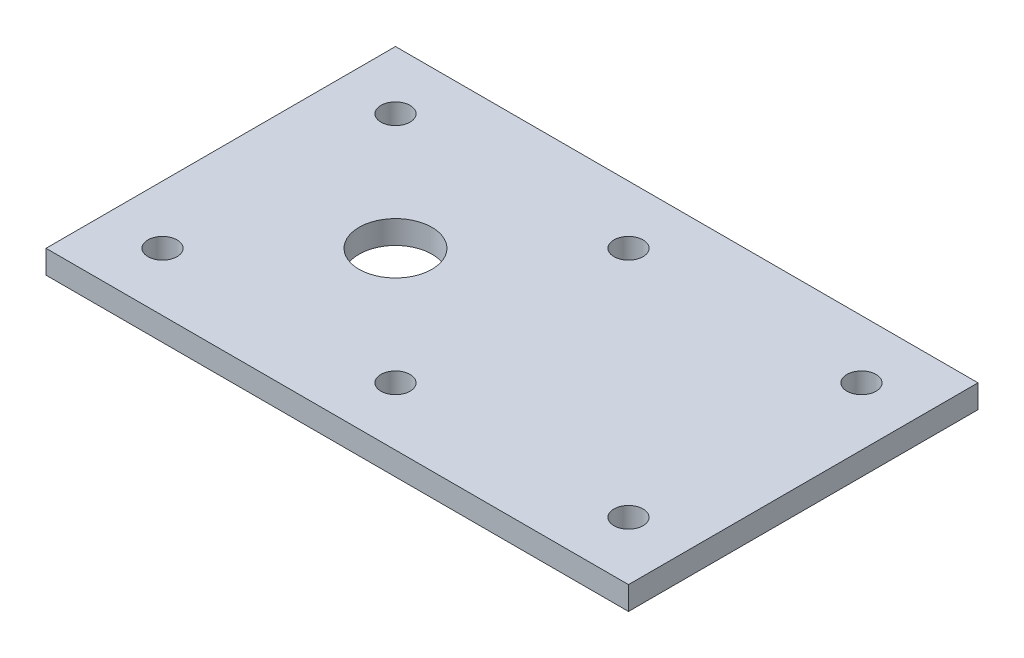
ISO-10303-21;
HEADER;
FILE_DESCRIPTION(('STEP AP214'),'2;1');
FILE_NAME('part.step','',(''),(''),'','','');
FILE_SCHEMA(('AUTOMOTIVE_DESIGN { 1 0 10303 214 1 1 1 1 }'));
ENDSEC;
DATA;
#1=APPLICATION_CONTEXT('core data for automotive mechanical design processes');
#2=APPLICATION_PROTOCOL_DEFINITION('international standard','automotive_design',2000,#1);
#3=PRODUCT_CONTEXT('',#1,'mechanical');
#4=PRODUCT('Part','Part','',(#3));
#5=PRODUCT_RELATED_PRODUCT_CATEGORY('part','',(#4));
#6=PRODUCT_DEFINITION_FORMATION('','',#4);
#7=PRODUCT_DEFINITION_CONTEXT('part definition',#1,'design');
#8=PRODUCT_DEFINITION('design','',#6,#7);
#9=PRODUCT_DEFINITION_SHAPE('','',#8);
#10=(LENGTH_UNIT() NAMED_UNIT(*) SI_UNIT(.MILLI.,.METRE.));
#11=(NAMED_UNIT(*) PLANE_ANGLE_UNIT() SI_UNIT($,.RADIAN.));
#12=(NAMED_UNIT(*) SI_UNIT($,.STERADIAN.) SOLID_ANGLE_UNIT());
#13=UNCERTAINTY_MEASURE_WITH_UNIT(LENGTH_MEASURE(1.E-05),#10,'distance_accuracy_value','');
#14=(GEOMETRIC_REPRESENTATION_CONTEXT(3) GLOBAL_UNCERTAINTY_ASSIGNED_CONTEXT((#13)) GLOBAL_UNIT_ASSIGNED_CONTEXT((#10,
#11,#12)) REPRESENTATION_CONTEXT('',''));
#15=CARTESIAN_POINT('',(0.,0.,0.));
#16=DIRECTION('',(0.,0.,1.));
#17=DIRECTION('',(1.,0.,0.));
#18=AXIS2_PLACEMENT_3D('',#15,#16,#17);
#19=CARTESIAN_POINT('',(120.,0.,40.));
#20=DIRECTION('',(0.,1.,0.));
#21=DIRECTION('',(0.,0.,1.));
#22=AXIS2_PLACEMENT_3D('',#19,#20,#21);
#23=CYLINDRICAL_SURFACE('',#22,5.);
#24=CARTESIAN_POINT('',(120.,0.,40.));
#25=DIRECTION('',(0.,1.,0.));
#26=DIRECTION('',(0.,0.,1.));
#27=AXIS2_PLACEMENT_3D('',#24,#25,#26);
#28=CIRCLE('',#27,5.);
#29=CARTESIAN_POINT('',(120.,0.,45.));
#30=VERTEX_POINT('',#29);
#31=EDGE_CURVE('E42',#30,#30,#28,.T.);
#32=ORIENTED_EDGE('',*,*,#31,.F.);
#33=EDGE_LOOP('',(#32));
#34=FACE_BOUND('',#33,.T.);
#35=CARTESIAN_POINT('',(120.,8.,40.));
#36=DIRECTION('',(0.,1.,0.));
#37=DIRECTION('',(0.,0.,1.));
#38=AXIS2_PLACEMENT_3D('',#35,#36,#37);
#39=CIRCLE('',#38,5.);
#40=CARTESIAN_POINT('',(120.,8.,45.));
#41=VERTEX_POINT('',#40);
#42=EDGE_CURVE('E11',#41,#41,#39,.T.);
#43=ORIENTED_EDGE('',*,*,#42,.T.);
#44=EDGE_LOOP('',(#43));
#45=FACE_BOUND('',#44,.T.);
#46=ADVANCED_FACE('F33',(#34,#45),#23,.F.);
#47=CARTESIAN_POINT('',(120.,0.,-40.));
#48=DIRECTION('',(0.,1.,0.));
#49=DIRECTION('',(0.,0.,1.));
#50=AXIS2_PLACEMENT_3D('',#47,#48,#49);
#51=CYLINDRICAL_SURFACE('',#50,5.);
#52=CARTESIAN_POINT('',(120.,0.,-40.));
#53=DIRECTION('',(0.,1.,0.));
#54=DIRECTION('',(0.,0.,1.));
#55=AXIS2_PLACEMENT_3D('',#52,#53,#54);
#56=CIRCLE('',#55,5.);
#57=CARTESIAN_POINT('',(120.,0.,-35.));
#58=VERTEX_POINT('',#57);
#59=EDGE_CURVE('E124',#58,#58,#56,.T.);
#60=ORIENTED_EDGE('',*,*,#59,.F.);
#61=EDGE_LOOP('',(#60));
#62=FACE_BOUND('',#61,.T.);
#63=CARTESIAN_POINT('',(120.,8.,-40.));
#64=DIRECTION('',(0.,1.,0.));
#65=DIRECTION('',(0.,0.,1.));
#66=AXIS2_PLACEMENT_3D('',#63,#64,#65);
#67=CIRCLE('',#66,5.);
#68=CARTESIAN_POINT('',(120.,8.,-35.));
#69=VERTEX_POINT('',#68);
#70=EDGE_CURVE('E127',#69,#69,#67,.T.);
#71=ORIENTED_EDGE('',*,*,#70,.T.);
#72=EDGE_LOOP('',(#71));
#73=FACE_BOUND('',#72,.T.);
#74=ADVANCED_FACE('F137',(#62,#73),#51,.F.);
#75=CARTESIAN_POINT('',(40.,0.,40.));
#76=DIRECTION('',(0.,1.,0.));
#77=DIRECTION('',(0.,0.,1.));
#78=AXIS2_PLACEMENT_3D('',#75,#76,#77);
#79=CYLINDRICAL_SURFACE('',#78,5.);
#80=CARTESIAN_POINT('',(40.,0.,40.));
#81=DIRECTION('',(0.,1.,0.));
#82=DIRECTION('',(0.,0.,1.));
#83=AXIS2_PLACEMENT_3D('',#80,#81,#82);
#84=CIRCLE('',#83,5.);
#85=CARTESIAN_POINT('',(40.,0.,45.));
#86=VERTEX_POINT('',#85);
#87=EDGE_CURVE('E118',#86,#86,#84,.T.);
#88=ORIENTED_EDGE('',*,*,#87,.F.);
#89=EDGE_LOOP('',(#88));
#90=FACE_BOUND('',#89,.T.);
#91=CARTESIAN_POINT('',(40.,8.,40.));
#92=DIRECTION('',(0.,1.,0.));
#93=DIRECTION('',(0.,0.,1.));
#94=AXIS2_PLACEMENT_3D('',#91,#92,#93);
#95=CIRCLE('',#94,5.);
#96=CARTESIAN_POINT('',(40.,8.,45.));
#97=VERTEX_POINT('',#96);
#98=EDGE_CURVE('E121',#97,#97,#95,.T.);
#99=ORIENTED_EDGE('',*,*,#98,.T.);
#100=EDGE_LOOP('',(#99));
#101=FACE_BOUND('',#100,.T.);
#102=ADVANCED_FACE('F168',(#90,#101),#79,.F.);
#103=CARTESIAN_POINT('',(40.,0.,-40.));
#104=DIRECTION('',(0.,1.,0.));
#105=DIRECTION('',(0.,0.,1.));
#106=AXIS2_PLACEMENT_3D('',#103,#104,#105);
#107=CYLINDRICAL_SURFACE('',#106,5.);
#108=CARTESIAN_POINT('',(40.,0.,-40.));
#109=DIRECTION('',(0.,1.,0.));
#110=DIRECTION('',(0.,0.,1.));
#111=AXIS2_PLACEMENT_3D('',#108,#109,#110);
#112=CIRCLE('',#111,5.);
#113=CARTESIAN_POINT('',(40.,0.,-35.));
#114=VERTEX_POINT('',#113);
#115=EDGE_CURVE('E112',#114,#114,#112,.T.);
#116=ORIENTED_EDGE('',*,*,#115,.F.);
#117=EDGE_LOOP('',(#116));
#118=FACE_BOUND('',#117,.T.);
#119=CARTESIAN_POINT('',(40.,8.,-40.));
#120=DIRECTION('',(0.,1.,0.));
#121=DIRECTION('',(0.,0.,1.));
#122=AXIS2_PLACEMENT_3D('',#119,#120,#121);
#123=CIRCLE('',#122,5.);
#124=CARTESIAN_POINT('',(40.,8.,-35.));
#125=VERTEX_POINT('',#124);
#126=EDGE_CURVE('E115',#125,#125,#123,.T.);
#127=ORIENTED_EDGE('',*,*,#126,.T.);
#128=EDGE_LOOP('',(#127));
#129=FACE_BOUND('',#128,.T.);
#130=ADVANCED_FACE('F164',(#118,#129),#107,.F.);
#131=CARTESIAN_POINT('',(-60.,8.,-60.));
#132=DIRECTION('',(1.,0.,0.));
#133=DIRECTION('',(0.,0.,-1.));
#134=AXIS2_PLACEMENT_3D('',#131,#132,#133);
#135=PLANE('',#134);
#136=DIRECTION('',(0.,0.,1.));
#137=VECTOR('',#136,1.);
#138=CARTESIAN_POINT('',(-60.,0.,-60.));
#139=LINE('',#138,#137);
#140=CARTESIAN_POINT('',(-60.,0.,-60.));
#141=VERTEX_POINT('',#140);
#142=CARTESIAN_POINT('',(-60.,0.,60.));
#143=VERTEX_POINT('',#142);
#144=EDGE_CURVE('E102',#141,#143,#139,.T.);
#145=ORIENTED_EDGE('',*,*,#144,.T.);
#146=DIRECTION('',(0.,-1.,0.));
#147=VECTOR('',#146,1.);
#148=CARTESIAN_POINT('',(-60.,8.,60.));
#149=LINE('',#148,#147);
#150=CARTESIAN_POINT('',(-60.,8.,60.));
#151=VERTEX_POINT('',#150);
#152=EDGE_CURVE('E93',#151,#143,#149,.T.);
#153=ORIENTED_EDGE('',*,*,#152,.F.);
#154=DIRECTION('',(0.,0.,1.));
#155=VECTOR('',#154,1.);
#156=CARTESIAN_POINT('',(-60.,8.,-60.));
#157=LINE('',#156,#155);
#158=CARTESIAN_POINT('',(-60.,8.,-60.));
#159=VERTEX_POINT('',#158);
#160=EDGE_CURVE('E87',#159,#151,#157,.T.);
#161=ORIENTED_EDGE('',*,*,#160,.F.);
#162=DIRECTION('',(0.,-1.,0.));
#163=VECTOR('',#162,1.);
#164=CARTESIAN_POINT('',(-60.,8.,-60.));
#165=LINE('',#164,#163);
#166=EDGE_CURVE('E98',#159,#141,#165,.T.);
#167=ORIENTED_EDGE('',*,*,#166,.T.);
#168=EDGE_LOOP('',(#145,#153,#161,#167));
#169=FACE_BOUND('',#168,.T.);
#170=ADVANCED_FACE('F161',(#169),#135,.F.);
#171=CARTESIAN_POINT('',(-60.,8.,60.));
#172=DIRECTION('',(0.,0.,-1.));
#173=DIRECTION('',(-1.,0.,0.));
#174=AXIS2_PLACEMENT_3D('',#171,#172,#173);
#175=PLANE('',#174);
#176=DIRECTION('',(1.,0.,0.));
#177=VECTOR('',#176,1.);
#178=CARTESIAN_POINT('',(-60.,0.,60.));
#179=LINE('',#178,#177);
#180=CARTESIAN_POINT('',(140.,0.,60.));
#181=VERTEX_POINT('',#180);
#182=EDGE_CURVE('E92',#143,#181,#179,.T.);
#183=ORIENTED_EDGE('',*,*,#182,.T.);
#184=DIRECTION('',(0.,-1.,0.));
#185=VECTOR('',#184,1.);
#186=CARTESIAN_POINT('',(140.,8.,60.));
#187=LINE('',#186,#185);
#188=CARTESIAN_POINT('',(140.,8.,60.));
#189=VERTEX_POINT('',#188);
#190=EDGE_CURVE('E90',#189,#181,#187,.T.);
#191=ORIENTED_EDGE('',*,*,#190,.F.);
#192=DIRECTION('',(1.,0.,0.));
#193=VECTOR('',#192,1.);
#194=CARTESIAN_POINT('',(-60.,8.,60.));
#195=LINE('',#194,#193);
#196=EDGE_CURVE('E81',#151,#189,#195,.T.);
#197=ORIENTED_EDGE('',*,*,#196,.F.);
#198=ORIENTED_EDGE('',*,*,#152,.T.);
#199=EDGE_LOOP('',(#183,#191,#197,#198));
#200=FACE_BOUND('',#199,.T.);
#201=ADVANCED_FACE('F91',(#200),#175,.F.);
#202=CARTESIAN_POINT('',(140.,8.,-60.));
#203=DIRECTION('',(-1.,0.,0.));
#204=DIRECTION('',(0.,0.,1.));
#205=AXIS2_PLACEMENT_3D('',#202,#203,#204);
#206=PLANE('',#205);
#207=DIRECTION('',(0.,0.,-1.));
#208=VECTOR('',#207,1.);
#209=CARTESIAN_POINT('',(140.,0.,-60.));
#210=LINE('',#209,#208);
#211=CARTESIAN_POINT('',(140.,0.,-60.));
#212=VERTEX_POINT('',#211);
#213=EDGE_CURVE('E67',#181,#212,#210,.T.);
#214=ORIENTED_EDGE('',*,*,#213,.T.);
#215=DIRECTION('',(0.,-1.,0.));
#216=VECTOR('',#215,1.);
#217=CARTESIAN_POINT('',(140.,8.,-60.));
#218=LINE('',#217,#216);
#219=CARTESIAN_POINT('',(140.,8.,-60.));
#220=VERTEX_POINT('',#219);
#221=EDGE_CURVE('E94',#220,#212,#218,.T.);
#222=ORIENTED_EDGE('',*,*,#221,.F.);
#223=DIRECTION('',(0.,0.,-1.));
#224=VECTOR('',#223,1.);
#225=CARTESIAN_POINT('',(140.,8.,-60.));
#226=LINE('',#225,#224);
#227=EDGE_CURVE('E85',#189,#220,#226,.T.);
#228=ORIENTED_EDGE('',*,*,#227,.F.);
#229=ORIENTED_EDGE('',*,*,#190,.T.);
#230=EDGE_LOOP('',(#214,#222,#228,#229));
#231=FACE_BOUND('',#230,.T.);
#232=ADVANCED_FACE('F96',(#231),#206,.F.);
#233=CARTESIAN_POINT('',(-60.,8.,-60.));
#234=DIRECTION('',(0.,0.,1.));
#235=DIRECTION('',(1.,0.,0.));
#236=AXIS2_PLACEMENT_3D('',#233,#234,#235);
#237=PLANE('',#236);
#238=DIRECTION('',(-1.,0.,0.));
#239=VECTOR('',#238,1.);
#240=CARTESIAN_POINT('',(-60.,0.,-60.));
#241=LINE('',#240,#239);
#242=EDGE_CURVE('E73',#212,#141,#241,.T.);
#243=ORIENTED_EDGE('',*,*,#242,.T.);
#244=ORIENTED_EDGE('',*,*,#166,.F.);
#245=DIRECTION('',(-1.,0.,0.));
#246=VECTOR('',#245,1.);
#247=CARTESIAN_POINT('',(-60.,8.,-60.));
#248=LINE('',#247,#246);
#249=EDGE_CURVE('E50',#220,#159,#248,.T.);
#250=ORIENTED_EDGE('',*,*,#249,.F.);
#251=ORIENTED_EDGE('',*,*,#221,.T.);
#252=EDGE_LOOP('',(#243,#244,#250,#251));
#253=FACE_BOUND('',#252,.T.);
#254=ADVANCED_FACE('F141',(#253),#237,.F.);
#255=CARTESIAN_POINT('',(0.,8.,0.));
#256=DIRECTION('',(0.,1.,0.));
#257=DIRECTION('',(0.,0.,1.));
#258=AXIS2_PLACEMENT_3D('',#255,#256,#257);
#259=PLANE('',#258);
#260=CARTESIAN_POINT('',(0.,8.,0.));
#261=DIRECTION('',(0.,1.,0.));
#262=DIRECTION('',(0.,0.,1.));
#263=AXIS2_PLACEMENT_3D('',#260,#261,#262);
#264=CIRCLE('',#263,12.5);
#265=CARTESIAN_POINT('',(0.,8.,12.5));
#266=VERTEX_POINT('',#265);
#267=EDGE_CURVE('E260',#266,#266,#264,.T.);
#268=ORIENTED_EDGE('',*,*,#267,.F.);
#269=EDGE_LOOP('',(#268));
#270=FACE_BOUND('',#269,.T.);
#271=CARTESIAN_POINT('',(-40.,8.,40.));
#272=DIRECTION('',(0.,1.,0.));
#273=DIRECTION('',(0.,0.,1.));
#274=AXIS2_PLACEMENT_3D('',#271,#272,#273);
#275=CIRCLE('',#274,5.);
#276=CARTESIAN_POINT('',(-40.,8.,45.));
#277=VERTEX_POINT('',#276);
#278=EDGE_CURVE('E265',#277,#277,#275,.T.);
#279=ORIENTED_EDGE('',*,*,#278,.F.);
#280=EDGE_LOOP('',(#279));
#281=FACE_BOUND('',#280,.T.);
#282=CARTESIAN_POINT('',(-40.,8.,-40.));
#283=DIRECTION('',(0.,1.,0.));
#284=DIRECTION('',(0.,0.,1.));
#285=AXIS2_PLACEMENT_3D('',#282,#283,#284);
#286=CIRCLE('',#285,5.);
#287=CARTESIAN_POINT('',(-40.,8.,-35.));
#288=VERTEX_POINT('',#287);
#289=EDGE_CURVE('E271',#288,#288,#286,.T.);
#290=ORIENTED_EDGE('',*,*,#289,.F.);
#291=EDGE_LOOP('',(#290));
#292=FACE_BOUND('',#291,.T.);
#293=ORIENTED_EDGE('',*,*,#160,.T.);
#294=ORIENTED_EDGE('',*,*,#196,.T.);
#295=ORIENTED_EDGE('',*,*,#227,.T.);
#296=ORIENTED_EDGE('',*,*,#249,.T.);
#297=EDGE_LOOP('',(#293,#294,#295,#296));
#298=FACE_BOUND('',#297,.T.);
#299=ORIENTED_EDGE('',*,*,#126,.F.);
#300=EDGE_LOOP('',(#299));
#301=FACE_BOUND('',#300,.T.);
#302=ORIENTED_EDGE('',*,*,#98,.F.);
#303=EDGE_LOOP('',(#302));
#304=FACE_BOUND('',#303,.T.);
#305=ORIENTED_EDGE('',*,*,#70,.F.);
#306=EDGE_LOOP('',(#305));
#307=FACE_BOUND('',#306,.T.);
#308=ORIENTED_EDGE('',*,*,#42,.F.);
#309=EDGE_LOOP('',(#308));
#310=FACE_BOUND('',#309,.T.);
#311=ADVANCED_FACE('F82',(#270,#281,#292,#298,#301,#304,#307,#310),#259,.T.);
#312=CARTESIAN_POINT('',(0.,0.,0.));
#313=DIRECTION('',(0.,1.,0.));
#314=DIRECTION('',(0.,0.,1.));
#315=AXIS2_PLACEMENT_3D('',#312,#313,#314);
#316=PLANE('',#315);
#317=CARTESIAN_POINT('',(0.,0.,0.));
#318=DIRECTION('',(0.,1.,0.));
#319=DIRECTION('',(0.,0.,1.));
#320=AXIS2_PLACEMENT_3D('',#317,#318,#319);
#321=CIRCLE('',#320,12.5);
#322=CARTESIAN_POINT('',(0.,0.,12.5));
#323=VERTEX_POINT('',#322);
#324=EDGE_CURVE('E36',#323,#323,#321,.T.);
#325=ORIENTED_EDGE('',*,*,#324,.T.);
#326=EDGE_LOOP('',(#325));
#327=FACE_BOUND('',#326,.T.);
#328=CARTESIAN_POINT('',(-40.,0.,40.));
#329=DIRECTION('',(0.,1.,0.));
#330=DIRECTION('',(0.,0.,1.));
#331=AXIS2_PLACEMENT_3D('',#328,#329,#330);
#332=CIRCLE('',#331,5.);
#333=CARTESIAN_POINT('',(-40.,0.,45.));
#334=VERTEX_POINT('',#333);
#335=EDGE_CURVE('E263',#334,#334,#332,.T.);
#336=ORIENTED_EDGE('',*,*,#335,.T.);
#337=EDGE_LOOP('',(#336));
#338=FACE_BOUND('',#337,.T.);
#339=CARTESIAN_POINT('',(-40.,0.,-40.));
#340=DIRECTION('',(0.,1.,0.));
#341=DIRECTION('',(0.,0.,1.));
#342=AXIS2_PLACEMENT_3D('',#339,#340,#341);
#343=CIRCLE('',#342,5.);
#344=CARTESIAN_POINT('',(-40.,0.,-35.));
#345=VERTEX_POINT('',#344);
#346=EDGE_CURVE('E105',#345,#345,#343,.T.);
#347=ORIENTED_EDGE('',*,*,#346,.T.);
#348=EDGE_LOOP('',(#347));
#349=FACE_BOUND('',#348,.T.);
#350=ORIENTED_EDGE('',*,*,#144,.F.);
#351=ORIENTED_EDGE('',*,*,#242,.F.);
#352=ORIENTED_EDGE('',*,*,#213,.F.);
#353=ORIENTED_EDGE('',*,*,#182,.F.);
#354=EDGE_LOOP('',(#350,#351,#352,#353));
#355=FACE_BOUND('',#354,.T.);
#356=ORIENTED_EDGE('',*,*,#115,.T.);
#357=EDGE_LOOP('',(#356));
#358=FACE_BOUND('',#357,.T.);
#359=ORIENTED_EDGE('',*,*,#87,.T.);
#360=EDGE_LOOP('',(#359));
#361=FACE_BOUND('',#360,.T.);
#362=ORIENTED_EDGE('',*,*,#59,.T.);
#363=EDGE_LOOP('',(#362));
#364=FACE_BOUND('',#363,.T.);
#365=ORIENTED_EDGE('',*,*,#31,.T.);
#366=EDGE_LOOP('',(#365));
#367=FACE_BOUND('',#366,.T.);
#368=ADVANCED_FACE('F133',(#327,#338,#349,#355,#358,#361,#364,#367),#316,.F.);
#369=CARTESIAN_POINT('',(-40.,0.,-40.));
#370=DIRECTION('',(0.,1.,0.));
#371=DIRECTION('',(0.,0.,1.));
#372=AXIS2_PLACEMENT_3D('',#369,#370,#371);
#373=CYLINDRICAL_SURFACE('',#372,5.);
#374=ORIENTED_EDGE('',*,*,#346,.F.);
#375=EDGE_LOOP('',(#374));
#376=FACE_BOUND('',#375,.T.);
#377=ORIENTED_EDGE('',*,*,#289,.T.);
#378=EDGE_LOOP('',(#377));
#379=FACE_BOUND('',#378,.T.);
#380=ADVANCED_FACE('F148',(#376,#379),#373,.F.);
#381=CARTESIAN_POINT('',(-40.,0.,40.));
#382=DIRECTION('',(0.,1.,0.));
#383=DIRECTION('',(0.,0.,1.));
#384=AXIS2_PLACEMENT_3D('',#381,#382,#383);
#385=CYLINDRICAL_SURFACE('',#384,5.);
#386=ORIENTED_EDGE('',*,*,#335,.F.);
#387=EDGE_LOOP('',(#386));
#388=FACE_BOUND('',#387,.T.);
#389=ORIENTED_EDGE('',*,*,#278,.T.);
#390=EDGE_LOOP('',(#389));
#391=FACE_BOUND('',#390,.T.);
#392=ADVANCED_FACE('F217',(#388,#391),#385,.F.);
#393=CARTESIAN_POINT('',(0.,-2.,0.));
#394=DIRECTION('',(0.,1.,0.));
#395=DIRECTION('',(0.,0.,1.));
#396=AXIS2_PLACEMENT_3D('',#393,#394,#395);
#397=CYLINDRICAL_SURFACE('',#396,12.5);
#398=ORIENTED_EDGE('',*,*,#267,.T.);
#399=EDGE_LOOP('',(#398));
#400=FACE_BOUND('',#399,.T.);
#401=ORIENTED_EDGE('',*,*,#324,.F.);
#402=EDGE_LOOP('',(#401));
#403=FACE_BOUND('',#402,.T.);
#404=ADVANCED_FACE('F238',(#400,#403),#397,.F.);
#405=CLOSED_SHELL('',(#46,#74,#102,#130,#170,#201,#232,#254,#311,#368,#380,#392,#404));
#406=MANIFOLD_SOLID_BREP('B2',#405);
#407=ADVANCED_BREP_SHAPE_REPRESENTATION('',(#18,#406),#14);
#408=SHAPE_DEFINITION_REPRESENTATION(#9,#407);
ENDSEC;
END-ISO-10303-21;
